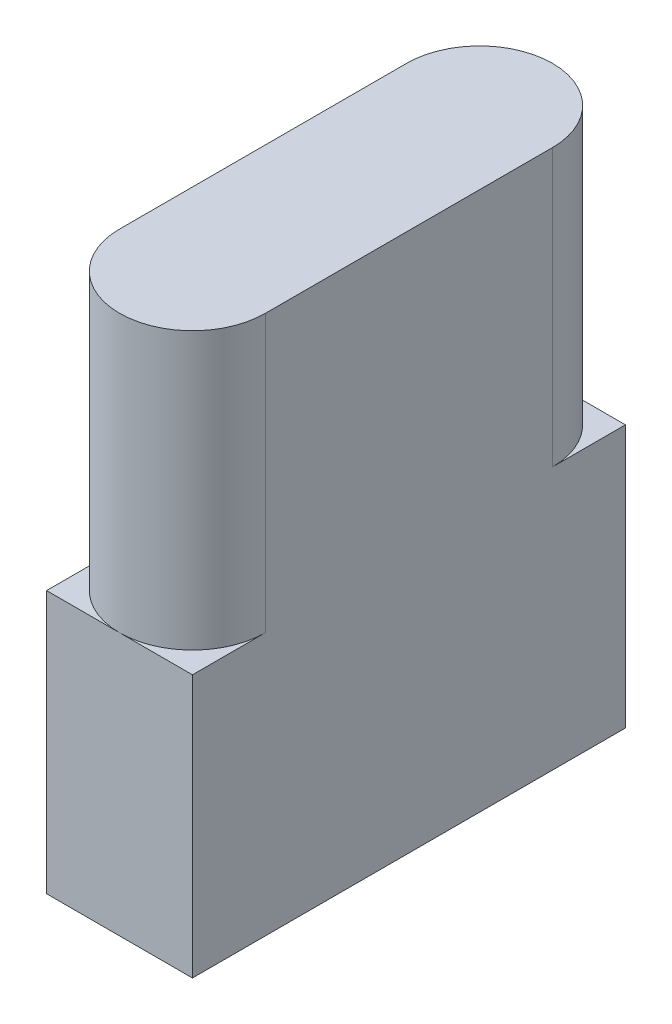
ISO-10303-21;
HEADER;
FILE_DESCRIPTION(('STEP AP214'),'2;1');
FILE_NAME('part.step','',(''),(''),'','','');
FILE_SCHEMA(('AUTOMOTIVE_DESIGN { 1 0 10303 214 1 1 1 1 }'));
ENDSEC;
DATA;
#1=APPLICATION_CONTEXT('core data for automotive mechanical design processes');
#2=APPLICATION_PROTOCOL_DEFINITION('international standard','automotive_design',2000,#1);
#3=PRODUCT_CONTEXT('',#1,'mechanical');
#4=PRODUCT('Part','Part','',(#3));
#5=PRODUCT_RELATED_PRODUCT_CATEGORY('part','',(#4));
#6=PRODUCT_DEFINITION_FORMATION('','',#4);
#7=PRODUCT_DEFINITION_CONTEXT('part definition',#1,'design');
#8=PRODUCT_DEFINITION('design','',#6,#7);
#9=PRODUCT_DEFINITION_SHAPE('','',#8);
#10=(LENGTH_UNIT() NAMED_UNIT(*) SI_UNIT(.MILLI.,.METRE.));
#11=(NAMED_UNIT(*) PLANE_ANGLE_UNIT() SI_UNIT($,.RADIAN.));
#12=(NAMED_UNIT(*) SI_UNIT($,.STERADIAN.) SOLID_ANGLE_UNIT());
#13=UNCERTAINTY_MEASURE_WITH_UNIT(LENGTH_MEASURE(1.E-05),#10,'distance_accuracy_value','');
#14=(GEOMETRIC_REPRESENTATION_CONTEXT(3) GLOBAL_UNCERTAINTY_ASSIGNED_CONTEXT((#13)) GLOBAL_UNIT_ASSIGNED_CONTEXT((#10,
#11,#12)) REPRESENTATION_CONTEXT('',''));
#15=CARTESIAN_POINT('',(0.,0.,0.));
#16=DIRECTION('',(0.,0.,1.));
#17=DIRECTION('',(1.,0.,0.));
#18=AXIS2_PLACEMENT_3D('',#15,#16,#17);
#19=CARTESIAN_POINT('',(0.,10.5000000405586,0.));
#20=DIRECTION('',(0.,1.,0.));
#21=DIRECTION('',(1.,0.,0.));
#22=AXIS2_PLACEMENT_3D('',#19,#20,#21);
#23=PLANE('',#22);
#24=CARTESIAN_POINT('',(23.5837659994613,10.5000000405586,48.7440656521431));
#25=DIRECTION('',(0.,-1.,0.));
#26=DIRECTION('',(-1.,0.,0.));
#27=AXIS2_PLACEMENT_3D('',#24,#25,#26);
#28=CIRCLE('',#27,2.5);
#29=CARTESIAN_POINT('',(23.5837659994613,10.5000000405586,51.2440656521431));
#30=VERTEX_POINT('',#29);
#31=CARTESIAN_POINT('',(21.0837659994613,10.5000000405586,48.7440656521431));
#32=VERTEX_POINT('',#31);
#33=EDGE_CURVE('E196',#30,#32,#28,.T.);
#34=ORIENTED_EDGE('',*,*,#33,.T.);
#35=DIRECTION('',(0.,0.,1.));
#36=VECTOR('',#35,1.);
#37=CARTESIAN_POINT('',(21.0837659994613,10.5000000405586,51.2440656521431));
#38=LINE('',#37,#36);
#39=CARTESIAN_POINT('',(21.0837659994613,10.5000000405586,51.2440656521431));
#40=VERTEX_POINT('',#39);
#41=EDGE_CURVE('E27',#32,#40,#38,.T.);
#42=ORIENTED_EDGE('',*,*,#41,.T.);
#43=DIRECTION('',(1.,0.,0.));
#44=VECTOR('',#43,1.);
#45=CARTESIAN_POINT('',(26.0837659994613,10.5000000405586,51.2440656521431));
#46=LINE('',#45,#44);
#47=EDGE_CURVE('E102',#40,#30,#46,.T.);
#48=ORIENTED_EDGE('',*,*,#47,.T.);
#49=EDGE_LOOP('',(#34,#42,#48));
#50=FACE_BOUND('',#49,.T.);
#51=ADVANCED_FACE('F17',(#50),#23,.T.);
#52=CARTESIAN_POINT('',(26.0837659994613,1.50000004055861,36.4040656521431));
#53=DIRECTION('',(0.,0.,-1.));
#54=DIRECTION('',(0.,-1.,0.));
#55=AXIS2_PLACEMENT_3D('',#52,#53,#54);
#56=PLANE('',#55);
#57=DIRECTION('',(1.,0.,0.));
#58=VECTOR('',#57,1.);
#59=CARTESIAN_POINT('',(13.0418829997307,1.5,36.4040656521431));
#60=LINE('',#59,#58);
#61=CARTESIAN_POINT('',(21.0837659994613,1.50000004055861,36.4040656521431));
#62=VERTEX_POINT('',#61);
#63=CARTESIAN_POINT('',(26.0837659994613,1.50000004055861,36.4040656521431));
#64=VERTEX_POINT('',#63);
#65=EDGE_CURVE('E226',#62,#64,#60,.T.);
#66=ORIENTED_EDGE('',*,*,#65,.F.);
#67=DIRECTION('',(0.,1.,0.));
#68=VECTOR('',#67,1.);
#69=CARTESIAN_POINT('',(21.0837659994613,1.50000004055861,36.4040656521431));
#70=LINE('',#69,#68);
#71=CARTESIAN_POINT('',(21.0837659994613,10.5000000405586,36.4040656521431));
#72=VERTEX_POINT('',#71);
#73=EDGE_CURVE('E11',#62,#72,#70,.T.);
#74=ORIENTED_EDGE('',*,*,#73,.T.);
#75=DIRECTION('',(-1.,0.,0.));
#76=VECTOR('',#75,1.);
#77=CARTESIAN_POINT('',(21.0837659994613,10.5000000405586,36.4040656521431));
#78=LINE('',#77,#76);
#79=CARTESIAN_POINT('',(23.5837659994613,10.5000000405586,36.4040656521431));
#80=VERTEX_POINT('',#79);
#81=EDGE_CURVE('E133',#80,#72,#78,.T.);
#82=ORIENTED_EDGE('',*,*,#81,.F.);
#83=DIRECTION('',(-1.,0.,0.));
#84=VECTOR('',#83,1.);
#85=CARTESIAN_POINT('',(21.0837659994613,10.5000000405586,36.4040656521431));
#86=LINE('',#85,#84);
#87=CARTESIAN_POINT('',(26.0837659994613,10.5000000405586,36.4040656521431));
#88=VERTEX_POINT('',#87);
#89=EDGE_CURVE('E136',#88,#80,#86,.T.);
#90=ORIENTED_EDGE('',*,*,#89,.F.);
#91=DIRECTION('',(0.,1.,0.));
#92=VECTOR('',#91,1.);
#93=CARTESIAN_POINT('',(26.0837659994613,1.50000004055861,36.4040656521431));
#94=LINE('',#93,#92);
#95=EDGE_CURVE('E73',#64,#88,#94,.T.);
#96=ORIENTED_EDGE('',*,*,#95,.F.);
#97=EDGE_LOOP('',(#66,#74,#82,#90,#96));
#98=FACE_BOUND('',#97,.T.);
#99=ADVANCED_FACE('F135',(#98),#56,.T.);
#100=CARTESIAN_POINT('',(21.0837659994613,1.50000004055861,36.4040656521431));
#101=DIRECTION('',(-1.,0.,0.));
#102=DIRECTION('',(0.,0.,1.));
#103=AXIS2_PLACEMENT_3D('',#100,#101,#102);
#104=PLANE('',#103);
#105=DIRECTION('',(0.,0.,-1.));
#106=VECTOR('',#105,1.);
#107=CARTESIAN_POINT('',(21.0837659994613,1.5,18.2020328260715));
#108=LINE('',#107,#106);
#109=CARTESIAN_POINT('',(21.0837659994613,1.50000004055861,51.2440656521431));
#110=VERTEX_POINT('',#109);
#111=EDGE_CURVE('E223',#110,#62,#108,.T.);
#112=ORIENTED_EDGE('',*,*,#111,.F.);
#113=DIRECTION('',(0.,1.,0.));
#114=VECTOR('',#113,1.);
#115=CARTESIAN_POINT('',(21.0837659994613,1.50000004055861,51.2440656521431));
#116=LINE('',#115,#114);
#117=EDGE_CURVE('E95',#110,#40,#116,.T.);
#118=ORIENTED_EDGE('',*,*,#117,.T.);
#119=ORIENTED_EDGE('',*,*,#41,.F.);
#120=DIRECTION('',(0.,1.,0.));
#121=VECTOR('',#120,1.);
#122=CARTESIAN_POINT('',(21.0837659994613,10.5000000405586,48.7440656521431));
#123=LINE('',#122,#121);
#124=CARTESIAN_POINT('',(21.0837659994613,19.9800000405586,48.7440656521431));
#125=VERTEX_POINT('',#124);
#126=EDGE_CURVE('E166',#32,#125,#123,.T.);
#127=ORIENTED_EDGE('',*,*,#126,.T.);
#128=DIRECTION('',(0.,0.,1.));
#129=VECTOR('',#128,1.);
#130=CARTESIAN_POINT('',(21.0837659994613,19.9800000405586,38.9040656521431));
#131=LINE('',#130,#129);
#132=CARTESIAN_POINT('',(21.0837659994613,19.9800000405586,38.9040656521431));
#133=VERTEX_POINT('',#132);
#134=EDGE_CURVE('E177',#133,#125,#131,.T.);
#135=ORIENTED_EDGE('',*,*,#134,.F.);
#136=DIRECTION('',(0.,1.,0.));
#137=VECTOR('',#136,1.);
#138=CARTESIAN_POINT('',(21.0837659994613,10.5000000405586,38.9040656521431));
#139=LINE('',#138,#137);
#140=CARTESIAN_POINT('',(21.0837659994613,10.5000000405586,38.9040656521431));
#141=VERTEX_POINT('',#140);
#142=EDGE_CURVE('E20',#141,#133,#139,.T.);
#143=ORIENTED_EDGE('',*,*,#142,.F.);
#144=DIRECTION('',(0.,0.,1.));
#145=VECTOR('',#144,1.);
#146=CARTESIAN_POINT('',(21.0837659994613,10.5000000405586,51.2440656521431));
#147=LINE('',#146,#145);
#148=EDGE_CURVE('E141',#72,#141,#147,.T.);
#149=ORIENTED_EDGE('',*,*,#148,.F.);
#150=ORIENTED_EDGE('',*,*,#73,.F.);
#151=EDGE_LOOP('',(#112,#118,#119,#127,#135,#143,#149,#150));
#152=FACE_BOUND('',#151,.T.);
#153=ADVANCED_FACE('F247',(#152),#104,.T.);
#154=CARTESIAN_POINT('',(21.0837659994613,1.50000004055861,51.2440656521431));
#155=DIRECTION('',(0.,0.,1.));
#156=DIRECTION('',(1.,0.,0.));
#157=AXIS2_PLACEMENT_3D('',#154,#155,#156);
#158=PLANE('',#157);
#159=DIRECTION('',(-1.,0.,0.));
#160=VECTOR('',#159,1.);
#161=CARTESIAN_POINT('',(10.5418829997307,1.5,51.2440656521431));
#162=LINE('',#161,#160);
#163=CARTESIAN_POINT('',(26.0837659994613,1.50000004055861,51.2440656521431));
#164=VERTEX_POINT('',#163);
#165=EDGE_CURVE('E202',#164,#110,#162,.T.);
#166=ORIENTED_EDGE('',*,*,#165,.F.);
#167=DIRECTION('',(0.,1.,0.));
#168=VECTOR('',#167,1.);
#169=CARTESIAN_POINT('',(26.0837659994613,1.50000004055861,51.2440656521431));
#170=LINE('',#169,#168);
#171=CARTESIAN_POINT('',(26.0837659994613,10.5000000405586,51.2440656521431));
#172=VERTEX_POINT('',#171);
#173=EDGE_CURVE('E182',#164,#172,#170,.T.);
#174=ORIENTED_EDGE('',*,*,#173,.T.);
#175=DIRECTION('',(1.,0.,0.));
#176=VECTOR('',#175,1.);
#177=CARTESIAN_POINT('',(26.0837659994613,10.5000000405586,51.2440656521431));
#178=LINE('',#177,#176);
#179=EDGE_CURVE('E150',#30,#172,#178,.T.);
#180=ORIENTED_EDGE('',*,*,#179,.F.);
#181=ORIENTED_EDGE('',*,*,#47,.F.);
#182=ORIENTED_EDGE('',*,*,#117,.F.);
#183=EDGE_LOOP('',(#166,#174,#180,#181,#182));
#184=FACE_BOUND('',#183,.T.);
#185=ADVANCED_FACE('F248',(#184),#158,.T.);
#186=CARTESIAN_POINT('',(26.0837659994613,1.50000004055861,51.2440656521431));
#187=DIRECTION('',(1.,0.,0.));
#188=DIRECTION('',(0.,1.,0.));
#189=AXIS2_PLACEMENT_3D('',#186,#187,#188);
#190=PLANE('',#189);
#191=DIRECTION('',(0.,0.,1.));
#192=VECTOR('',#191,1.);
#193=CARTESIAN_POINT('',(26.0837659994613,1.5,25.6220328260715));
#194=LINE('',#193,#192);
#195=EDGE_CURVE('E232',#64,#164,#194,.T.);
#196=ORIENTED_EDGE('',*,*,#195,.F.);
#197=ORIENTED_EDGE('',*,*,#95,.T.);
#198=DIRECTION('',(0.,0.,-1.));
#199=VECTOR('',#198,1.);
#200=CARTESIAN_POINT('',(26.0837659994613,10.5000000405586,36.4040656521431));
#201=LINE('',#200,#199);
#202=CARTESIAN_POINT('',(26.0837659994613,10.5000000405586,38.9040656521431));
#203=VERTEX_POINT('',#202);
#204=EDGE_CURVE('E148',#203,#88,#201,.T.);
#205=ORIENTED_EDGE('',*,*,#204,.F.);
#206=DIRECTION('',(0.,1.,0.));
#207=VECTOR('',#206,1.);
#208=CARTESIAN_POINT('',(26.0837659994613,10.5000000405586,38.9040656521431));
#209=LINE('',#208,#207);
#210=CARTESIAN_POINT('',(26.0837659994613,19.9800000405586,38.9040656521431));
#211=VERTEX_POINT('',#210);
#212=EDGE_CURVE('E164',#203,#211,#209,.T.);
#213=ORIENTED_EDGE('',*,*,#212,.T.);
#214=DIRECTION('',(0.,0.,-1.));
#215=VECTOR('',#214,1.);
#216=CARTESIAN_POINT('',(26.0837659994613,19.9800000405586,48.7440656521431));
#217=LINE('',#216,#215);
#218=CARTESIAN_POINT('',(26.0837659994613,19.9800000405586,48.7440656521431));
#219=VERTEX_POINT('',#218);
#220=EDGE_CURVE('E180',#219,#211,#217,.T.);
#221=ORIENTED_EDGE('',*,*,#220,.F.);
#222=DIRECTION('',(0.,1.,0.));
#223=VECTOR('',#222,1.);
#224=CARTESIAN_POINT('',(26.0837659994613,10.5000000405586,48.7440656521431));
#225=LINE('',#224,#223);
#226=CARTESIAN_POINT('',(26.0837659994613,10.5000000405586,48.7440656521431));
#227=VERTEX_POINT('',#226);
#228=EDGE_CURVE('E183',#227,#219,#225,.T.);
#229=ORIENTED_EDGE('',*,*,#228,.F.);
#230=DIRECTION('',(0.,0.,-1.));
#231=VECTOR('',#230,1.);
#232=CARTESIAN_POINT('',(26.0837659994613,10.5000000405586,36.4040656521431));
#233=LINE('',#232,#231);
#234=EDGE_CURVE('E116',#172,#227,#233,.T.);
#235=ORIENTED_EDGE('',*,*,#234,.F.);
#236=ORIENTED_EDGE('',*,*,#173,.F.);
#237=EDGE_LOOP('',(#196,#197,#205,#213,#221,#229,#235,#236));
#238=FACE_BOUND('',#237,.T.);
#239=ADVANCED_FACE('F260',(#238),#190,.T.);
#240=CARTESIAN_POINT('',(0.,10.5000000405586,0.));
#241=DIRECTION('',(0.,1.,0.));
#242=DIRECTION('',(1.,0.,0.));
#243=AXIS2_PLACEMENT_3D('',#240,#241,#242);
#244=PLANE('',#243);
#245=CARTESIAN_POINT('',(23.5837659994613,10.5000000405586,38.9040656521431));
#246=DIRECTION('',(0.,-1.,0.));
#247=DIRECTION('',(1.,0.,0.));
#248=AXIS2_PLACEMENT_3D('',#245,#246,#247);
#249=CIRCLE('',#248,2.5);
#250=EDGE_CURVE('E153',#141,#80,#249,.T.);
#251=ORIENTED_EDGE('',*,*,#250,.T.);
#252=ORIENTED_EDGE('',*,*,#81,.T.);
#253=ORIENTED_EDGE('',*,*,#148,.T.);
#254=EDGE_LOOP('',(#251,#252,#253));
#255=FACE_BOUND('',#254,.T.);
#256=ADVANCED_FACE('F154',(#255),#244,.T.);
#257=CARTESIAN_POINT('',(0.,10.5000000405586,0.));
#258=DIRECTION('',(0.,1.,0.));
#259=DIRECTION('',(1.,0.,0.));
#260=AXIS2_PLACEMENT_3D('',#257,#258,#259);
#261=PLANE('',#260);
#262=CARTESIAN_POINT('',(23.5837659994613,10.5000000405586,48.7440656521431));
#263=DIRECTION('',(0.,-1.,0.));
#264=DIRECTION('',(-1.,0.,0.));
#265=AXIS2_PLACEMENT_3D('',#262,#263,#264);
#266=CIRCLE('',#265,2.5);
#267=EDGE_CURVE('E186',#227,#30,#266,.T.);
#268=ORIENTED_EDGE('',*,*,#267,.T.);
#269=ORIENTED_EDGE('',*,*,#179,.T.);
#270=ORIENTED_EDGE('',*,*,#234,.T.);
#271=EDGE_LOOP('',(#268,#269,#270));
#272=FACE_BOUND('',#271,.T.);
#273=ADVANCED_FACE('F249',(#272),#261,.T.);
#274=CARTESIAN_POINT('',(0.,10.5000000405586,0.));
#275=DIRECTION('',(0.,1.,0.));
#276=DIRECTION('',(1.,0.,0.));
#277=AXIS2_PLACEMENT_3D('',#274,#275,#276);
#278=PLANE('',#277);
#279=CARTESIAN_POINT('',(23.5837659994613,10.5000000405586,38.9040656521431));
#280=DIRECTION('',(0.,-1.,0.));
#281=DIRECTION('',(1.,0.,0.));
#282=AXIS2_PLACEMENT_3D('',#279,#280,#281);
#283=CIRCLE('',#282,2.5);
#284=EDGE_CURVE('E147',#80,#203,#283,.T.);
#285=ORIENTED_EDGE('',*,*,#284,.T.);
#286=ORIENTED_EDGE('',*,*,#204,.T.);
#287=ORIENTED_EDGE('',*,*,#89,.T.);
#288=EDGE_LOOP('',(#285,#286,#287));
#289=FACE_BOUND('',#288,.T.);
#290=ADVANCED_FACE('F145',(#289),#278,.T.);
#291=CARTESIAN_POINT('',(23.5837659994613,19.9800000811172,43.8240656521431));
#292=DIRECTION('',(0.,1.,0.));
#293=DIRECTION('',(1.,0.,0.));
#294=AXIS2_PLACEMENT_3D('',#291,#292,#293);
#295=PLANE('',#294);
#296=CARTESIAN_POINT('',(23.5837659994613,19.9800000405586,38.9040656521431));
#297=DIRECTION('',(0.,1.,0.));
#298=DIRECTION('',(1.,0.,0.));
#299=AXIS2_PLACEMENT_3D('',#296,#297,#298);
#300=CIRCLE('',#299,2.5);
#301=EDGE_CURVE('E210',#211,#133,#300,.T.);
#302=ORIENTED_EDGE('',*,*,#301,.T.);
#303=ORIENTED_EDGE('',*,*,#134,.T.);
#304=CARTESIAN_POINT('',(23.5837659994613,19.9800000405586,48.7440656521431));
#305=DIRECTION('',(0.,1.,0.));
#306=DIRECTION('',(-1.,0.,0.));
#307=AXIS2_PLACEMENT_3D('',#304,#305,#306);
#308=CIRCLE('',#307,2.5);
#309=EDGE_CURVE('E172',#125,#219,#308,.T.);
#310=ORIENTED_EDGE('',*,*,#309,.T.);
#311=ORIENTED_EDGE('',*,*,#220,.T.);
#312=EDGE_LOOP('',(#302,#303,#310,#311));
#313=FACE_BOUND('',#312,.T.);
#314=ADVANCED_FACE('F258',(#313),#295,.T.);
#315=CARTESIAN_POINT('',(23.5837659994613,10.5000000405586,38.9040656521431));
#316=DIRECTION('',(0.,1.,0.));
#317=DIRECTION('',(1.,0.,0.));
#318=AXIS2_PLACEMENT_3D('',#315,#316,#317);
#319=CYLINDRICAL_SURFACE('',#318,2.5);
#320=ORIENTED_EDGE('',*,*,#284,.F.);
#321=ORIENTED_EDGE('',*,*,#250,.F.);
#322=ORIENTED_EDGE('',*,*,#142,.T.);
#323=ORIENTED_EDGE('',*,*,#301,.F.);
#324=ORIENTED_EDGE('',*,*,#212,.F.);
#325=EDGE_LOOP('',(#320,#321,#322,#323,#324));
#326=FACE_BOUND('',#325,.T.);
#327=ADVANCED_FACE('F161',(#326),#319,.T.);
#328=CARTESIAN_POINT('',(23.5837659994613,10.5000000405586,48.7440656521431));
#329=DIRECTION('',(0.,1.,0.));
#330=DIRECTION('',(-1.,0.,0.));
#331=AXIS2_PLACEMENT_3D('',#328,#329,#330);
#332=CYLINDRICAL_SURFACE('',#331,2.5);
#333=ORIENTED_EDGE('',*,*,#33,.F.);
#334=ORIENTED_EDGE('',*,*,#267,.F.);
#335=ORIENTED_EDGE('',*,*,#228,.T.);
#336=ORIENTED_EDGE('',*,*,#309,.F.);
#337=ORIENTED_EDGE('',*,*,#126,.F.);
#338=EDGE_LOOP('',(#333,#334,#335,#336,#337));
#339=FACE_BOUND('',#338,.T.);
#340=ADVANCED_FACE('F269',(#339),#332,.T.);
#341=CARTESIAN_POINT('',(-0.14892918312297,1.49999995944139,0.));
#342=DIRECTION('',(0.,-1.,0.));
#343=DIRECTION('',(0.,0.,-1.));
#344=AXIS2_PLACEMENT_3D('',#341,#342,#343);
#345=PLANE('',#344);
#346=ORIENTED_EDGE('',*,*,#111,.T.);
#347=ORIENTED_EDGE('',*,*,#65,.T.);
#348=ORIENTED_EDGE('',*,*,#195,.T.);
#349=ORIENTED_EDGE('',*,*,#165,.T.);
#350=EDGE_LOOP('',(#346,#347,#348,#349));
#351=FACE_BOUND('',#350,.T.);
#352=ADVANCED_FACE('F246',(#351),#345,.T.);
#353=CLOSED_SHELL('',(#51,#99,#153,#185,#239,#256,#273,#290,#314,#327,#340,#352));
#354=MANIFOLD_SOLID_BREP('B1',#353);
#355=ADVANCED_BREP_SHAPE_REPRESENTATION('',(#18,#354),#14);
#356=SHAPE_DEFINITION_REPRESENTATION(#9,#355);
ENDSEC;
END-ISO-10303-21;
